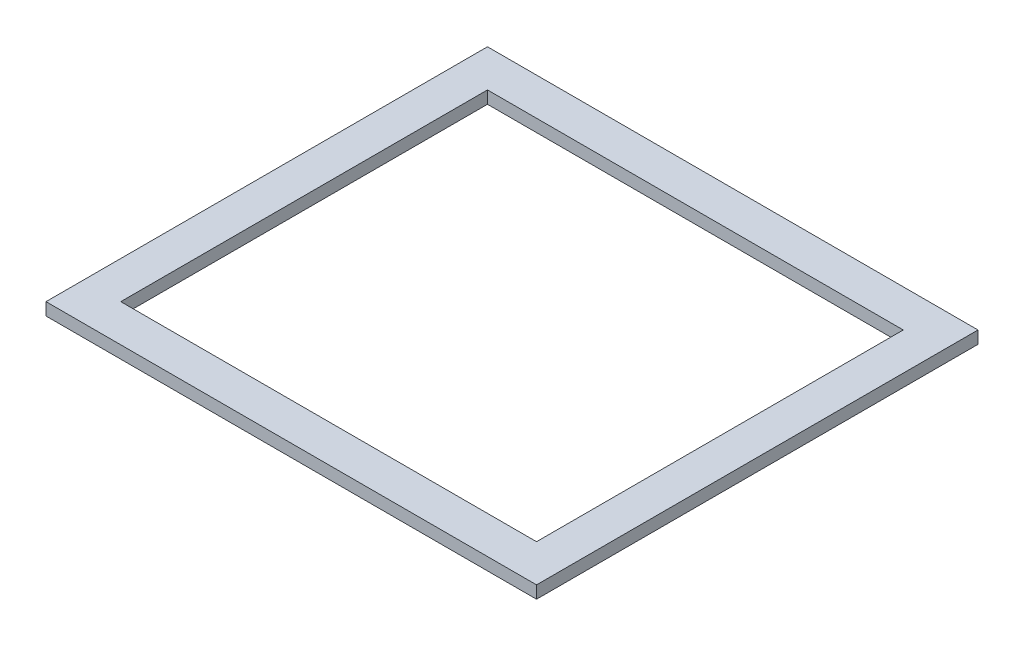
ISO-10303-21;
HEADER;
FILE_DESCRIPTION(('STEP AP214'),'2;1');
FILE_NAME('part.step','',(''),(''),'','','');
FILE_SCHEMA(('AUTOMOTIVE_DESIGN { 1 0 10303 214 1 1 1 1 }'));
ENDSEC;
DATA;
#1=APPLICATION_CONTEXT('core data for automotive mechanical design processes');
#2=APPLICATION_PROTOCOL_DEFINITION('international standard','automotive_design',2000,#1);
#3=PRODUCT_CONTEXT('',#1,'mechanical');
#4=PRODUCT('Part','Part','',(#3));
#5=PRODUCT_RELATED_PRODUCT_CATEGORY('part','',(#4));
#6=PRODUCT_DEFINITION_FORMATION('','',#4);
#7=PRODUCT_DEFINITION_CONTEXT('part definition',#1,'design');
#8=PRODUCT_DEFINITION('design','',#6,#7);
#9=PRODUCT_DEFINITION_SHAPE('','',#8);
#10=(LENGTH_UNIT() NAMED_UNIT(*) SI_UNIT(.MILLI.,.METRE.));
#11=(NAMED_UNIT(*) PLANE_ANGLE_UNIT() SI_UNIT($,.RADIAN.));
#12=(NAMED_UNIT(*) SI_UNIT($,.STERADIAN.) SOLID_ANGLE_UNIT());
#13=UNCERTAINTY_MEASURE_WITH_UNIT(LENGTH_MEASURE(1.E-05),#10,'distance_accuracy_value','');
#14=(GEOMETRIC_REPRESENTATION_CONTEXT(3) GLOBAL_UNCERTAINTY_ASSIGNED_CONTEXT((#13)) GLOBAL_UNIT_ASSIGNED_CONTEXT((#10,
#11,#12)) REPRESENTATION_CONTEXT('',''));
#15=CARTESIAN_POINT('',(0.,0.,0.));
#16=DIRECTION('',(0.,0.,1.));
#17=DIRECTION('',(1.,0.,0.));
#18=AXIS2_PLACEMENT_3D('',#15,#16,#17);
#19=CARTESIAN_POINT('',(0.,25.4,0.));
#20=DIRECTION('',(0.,1.,0.));
#21=DIRECTION('',(0.,0.,1.));
#22=AXIS2_PLACEMENT_3D('',#19,#20,#21);
#23=PLANE('',#22);
#24=DIRECTION('',(0.,0.,1.));
#25=VECTOR('',#24,1.);
#26=CARTESIAN_POINT('',(0.,25.4,0.));
#27=LINE('',#26,#25);
#28=CARTESIAN_POINT('',(0.,25.4,0.));
#29=VERTEX_POINT('',#28);
#30=CARTESIAN_POINT('',(1.10218211923262E-13,25.4,900.));
#31=VERTEX_POINT('',#30);
#32=EDGE_CURVE('E136',#29,#31,#27,.T.);
#33=ORIENTED_EDGE('',*,*,#32,.T.);
#34=DIRECTION('',(1.,0.,0.));
#35=VECTOR('',#34,1.);
#36=CARTESIAN_POINT('',(1.10218211923262E-13,25.4,900.));
#37=LINE('',#36,#35);
#38=CARTESIAN_POINT('',(1000.,25.4,900.));
#39=VERTEX_POINT('',#38);
#40=EDGE_CURVE('E139',#31,#39,#37,.T.);
#41=ORIENTED_EDGE('',*,*,#40,.T.);
#42=DIRECTION('',(0.,0.,-1.));
#43=VECTOR('',#42,1.);
#44=CARTESIAN_POINT('',(1000.,25.4,0.));
#45=LINE('',#44,#43);
#46=CARTESIAN_POINT('',(1000.,25.4,0.));
#47=VERTEX_POINT('',#46);
#48=EDGE_CURVE('E142',#39,#47,#45,.T.);
#49=ORIENTED_EDGE('',*,*,#48,.T.);
#50=DIRECTION('',(-1.,0.,0.));
#51=VECTOR('',#50,1.);
#52=CARTESIAN_POINT('',(0.,25.4,0.));
#53=LINE('',#52,#51);
#54=EDGE_CURVE('E144',#47,#29,#53,.T.);
#55=ORIENTED_EDGE('',*,*,#54,.T.);
#56=EDGE_LOOP('',(#33,#41,#49,#55));
#57=FACE_BOUND('',#56,.T.);
#58=DIRECTION('',(1.,0.,0.));
#59=VECTOR('',#58,1.);
#60=CARTESIAN_POINT('',(76.2000000000001,25.4,823.8));
#61=LINE('',#60,#59);
#62=CARTESIAN_POINT('',(76.2000000000001,25.4,823.8));
#63=VERTEX_POINT('',#62);
#64=CARTESIAN_POINT('',(923.8,25.4,823.8));
#65=VERTEX_POINT('',#64);
#66=EDGE_CURVE('E108',#63,#65,#61,.T.);
#67=ORIENTED_EDGE('',*,*,#66,.F.);
#68=DIRECTION('',(0.,0.,1.));
#69=VECTOR('',#68,1.);
#70=CARTESIAN_POINT('',(76.2,25.4,76.2));
#71=LINE('',#70,#69);
#72=CARTESIAN_POINT('',(76.2,25.4,76.2));
#73=VERTEX_POINT('',#72);
#74=EDGE_CURVE('E100',#73,#63,#71,.T.);
#75=ORIENTED_EDGE('',*,*,#74,.F.);
#76=DIRECTION('',(-1.,0.,0.));
#77=VECTOR('',#76,1.);
#78=CARTESIAN_POINT('',(76.2,25.4,76.2));
#79=LINE('',#78,#77);
#80=CARTESIAN_POINT('',(923.8,25.4,76.2));
#81=VERTEX_POINT('',#80);
#82=EDGE_CURVE('E122',#81,#73,#79,.T.);
#83=ORIENTED_EDGE('',*,*,#82,.F.);
#84=DIRECTION('',(0.,0.,-1.));
#85=VECTOR('',#84,1.);
#86=CARTESIAN_POINT('',(923.8,25.4,76.2));
#87=LINE('',#86,#85);
#88=EDGE_CURVE('E120',#65,#81,#87,.T.);
#89=ORIENTED_EDGE('',*,*,#88,.F.);
#90=EDGE_LOOP('',(#67,#75,#83,#89));
#91=FACE_BOUND('',#90,.T.);
#92=ADVANCED_FACE('F35',(#57,#91),#23,.T.);
#93=CARTESIAN_POINT('',(0.,0.,0.));
#94=DIRECTION('',(0.,1.,0.));
#95=DIRECTION('',(0.,0.,1.));
#96=AXIS2_PLACEMENT_3D('',#93,#94,#95);
#97=PLANE('',#96);
#98=DIRECTION('',(0.,0.,1.));
#99=VECTOR('',#98,1.);
#100=CARTESIAN_POINT('',(0.,0.,0.));
#101=LINE('',#100,#99);
#102=CARTESIAN_POINT('',(0.,0.,0.));
#103=VERTEX_POINT('',#102);
#104=CARTESIAN_POINT('',(1.10218211923262E-13,0.,900.));
#105=VERTEX_POINT('',#104);
#106=EDGE_CURVE('E116',#103,#105,#101,.T.);
#107=ORIENTED_EDGE('',*,*,#106,.F.);
#108=DIRECTION('',(-1.,0.,0.));
#109=VECTOR('',#108,1.);
#110=CARTESIAN_POINT('',(0.,0.,0.));
#111=LINE('',#110,#109);
#112=CARTESIAN_POINT('',(1000.,0.,0.));
#113=VERTEX_POINT('',#112);
#114=EDGE_CURVE('E140',#113,#103,#111,.T.);
#115=ORIENTED_EDGE('',*,*,#114,.F.);
#116=DIRECTION('',(0.,0.,-1.));
#117=VECTOR('',#116,1.);
#118=CARTESIAN_POINT('',(1000.,0.,0.));
#119=LINE('',#118,#117);
#120=CARTESIAN_POINT('',(1000.,0.,900.));
#121=VERTEX_POINT('',#120);
#122=EDGE_CURVE('E151',#121,#113,#119,.T.);
#123=ORIENTED_EDGE('',*,*,#122,.F.);
#124=DIRECTION('',(1.,0.,0.));
#125=VECTOR('',#124,1.);
#126=CARTESIAN_POINT('',(1.10218211923262E-13,0.,900.));
#127=LINE('',#126,#125);
#128=EDGE_CURVE('E149',#105,#121,#127,.T.);
#129=ORIENTED_EDGE('',*,*,#128,.F.);
#130=EDGE_LOOP('',(#107,#115,#123,#129));
#131=FACE_BOUND('',#130,.T.);
#132=DIRECTION('',(0.,0.,1.));
#133=VECTOR('',#132,1.);
#134=CARTESIAN_POINT('',(76.2,0.,76.2));
#135=LINE('',#134,#133);
#136=CARTESIAN_POINT('',(76.2,0.,76.2));
#137=VERTEX_POINT('',#136);
#138=CARTESIAN_POINT('',(76.2000000000001,0.,823.8));
#139=VERTEX_POINT('',#138);
#140=EDGE_CURVE('E58',#137,#139,#135,.T.);
#141=ORIENTED_EDGE('',*,*,#140,.T.);
#142=DIRECTION('',(1.,0.,0.));
#143=VECTOR('',#142,1.);
#144=CARTESIAN_POINT('',(76.2000000000001,0.,823.8));
#145=LINE('',#144,#143);
#146=CARTESIAN_POINT('',(923.8,0.,823.8));
#147=VERTEX_POINT('',#146);
#148=EDGE_CURVE('E115',#139,#147,#145,.T.);
#149=ORIENTED_EDGE('',*,*,#148,.T.);
#150=DIRECTION('',(0.,0.,-1.));
#151=VECTOR('',#150,1.);
#152=CARTESIAN_POINT('',(923.8,0.,76.2));
#153=LINE('',#152,#151);
#154=CARTESIAN_POINT('',(923.8,0.,76.2));
#155=VERTEX_POINT('',#154);
#156=EDGE_CURVE('E128',#147,#155,#153,.T.);
#157=ORIENTED_EDGE('',*,*,#156,.T.);
#158=DIRECTION('',(-1.,0.,0.));
#159=VECTOR('',#158,1.);
#160=CARTESIAN_POINT('',(76.2,0.,76.2));
#161=LINE('',#160,#159);
#162=EDGE_CURVE('E109',#155,#137,#161,.T.);
#163=ORIENTED_EDGE('',*,*,#162,.T.);
#164=EDGE_LOOP('',(#141,#149,#157,#163));
#165=FACE_BOUND('',#164,.T.);
#166=ADVANCED_FACE('F169',(#131,#165),#97,.F.);
#167=CARTESIAN_POINT('',(0.,25.4,0.));
#168=DIRECTION('',(1.,0.,0.));
#169=DIRECTION('',(0.,0.,-1.));
#170=AXIS2_PLACEMENT_3D('',#167,#168,#169);
#171=PLANE('',#170);
#172=ORIENTED_EDGE('',*,*,#106,.T.);
#173=DIRECTION('',(0.,-1.,0.));
#174=VECTOR('',#173,1.);
#175=CARTESIAN_POINT('',(1.10218211923262E-13,25.4,900.));
#176=LINE('',#175,#174);
#177=EDGE_CURVE('E11',#31,#105,#176,.T.);
#178=ORIENTED_EDGE('',*,*,#177,.F.);
#179=ORIENTED_EDGE('',*,*,#32,.F.);
#180=DIRECTION('',(0.,-1.,0.));
#181=VECTOR('',#180,1.);
#182=CARTESIAN_POINT('',(0.,25.4,0.));
#183=LINE('',#182,#181);
#184=EDGE_CURVE('E146',#29,#103,#183,.T.);
#185=ORIENTED_EDGE('',*,*,#184,.T.);
#186=EDGE_LOOP('',(#172,#178,#179,#185));
#187=FACE_BOUND('',#186,.T.);
#188=ADVANCED_FACE('F37',(#187),#171,.F.);
#189=CARTESIAN_POINT('',(1.10218211923262E-13,25.4,900.));
#190=DIRECTION('',(0.,0.,-1.));
#191=DIRECTION('',(-1.,0.,0.));
#192=AXIS2_PLACEMENT_3D('',#189,#190,#191);
#193=PLANE('',#192);
#194=ORIENTED_EDGE('',*,*,#128,.T.);
#195=DIRECTION('',(0.,-1.,0.));
#196=VECTOR('',#195,1.);
#197=CARTESIAN_POINT('',(1000.,25.4,900.));
#198=LINE('',#197,#196);
#199=EDGE_CURVE('E43',#39,#121,#198,.T.);
#200=ORIENTED_EDGE('',*,*,#199,.F.);
#201=ORIENTED_EDGE('',*,*,#40,.F.);
#202=ORIENTED_EDGE('',*,*,#177,.T.);
#203=EDGE_LOOP('',(#194,#200,#201,#202));
#204=FACE_BOUND('',#203,.T.);
#205=ADVANCED_FACE('F179',(#204),#193,.F.);
#206=CARTESIAN_POINT('',(1000.,25.4,0.));
#207=DIRECTION('',(-1.,0.,0.));
#208=DIRECTION('',(0.,0.,1.));
#209=AXIS2_PLACEMENT_3D('',#206,#207,#208);
#210=PLANE('',#209);
#211=ORIENTED_EDGE('',*,*,#122,.T.);
#212=DIRECTION('',(0.,-1.,0.));
#213=VECTOR('',#212,1.);
#214=CARTESIAN_POINT('',(1000.,25.4,0.));
#215=LINE('',#214,#213);
#216=EDGE_CURVE('E156',#47,#113,#215,.T.);
#217=ORIENTED_EDGE('',*,*,#216,.F.);
#218=ORIENTED_EDGE('',*,*,#48,.F.);
#219=ORIENTED_EDGE('',*,*,#199,.T.);
#220=EDGE_LOOP('',(#211,#217,#218,#219));
#221=FACE_BOUND('',#220,.T.);
#222=ADVANCED_FACE('F163',(#221),#210,.F.);
#223=CARTESIAN_POINT('',(0.,25.4,0.));
#224=DIRECTION('',(0.,0.,1.));
#225=DIRECTION('',(1.,0.,0.));
#226=AXIS2_PLACEMENT_3D('',#223,#224,#225);
#227=PLANE('',#226);
#228=ORIENTED_EDGE('',*,*,#114,.T.);
#229=ORIENTED_EDGE('',*,*,#184,.F.);
#230=ORIENTED_EDGE('',*,*,#54,.F.);
#231=ORIENTED_EDGE('',*,*,#216,.T.);
#232=EDGE_LOOP('',(#228,#229,#230,#231));
#233=FACE_BOUND('',#232,.T.);
#234=ADVANCED_FACE('F173',(#233),#227,.F.);
#235=CARTESIAN_POINT('',(76.2,25.4,76.2));
#236=DIRECTION('',(1.,0.,0.));
#237=DIRECTION('',(0.,0.,-1.));
#238=AXIS2_PLACEMENT_3D('',#235,#236,#237);
#239=PLANE('',#238);
#240=ORIENTED_EDGE('',*,*,#140,.F.);
#241=DIRECTION('',(0.,-1.,0.));
#242=VECTOR('',#241,1.);
#243=CARTESIAN_POINT('',(76.2,25.4,76.2));
#244=LINE('',#243,#242);
#245=EDGE_CURVE('E104',#73,#137,#244,.T.);
#246=ORIENTED_EDGE('',*,*,#245,.F.);
#247=ORIENTED_EDGE('',*,*,#74,.T.);
#248=DIRECTION('',(0.,-1.,0.));
#249=VECTOR('',#248,1.);
#250=CARTESIAN_POINT('',(76.2000000000001,25.4,823.8));
#251=LINE('',#250,#249);
#252=EDGE_CURVE('E103',#63,#139,#251,.T.);
#253=ORIENTED_EDGE('',*,*,#252,.T.);
#254=EDGE_LOOP('',(#240,#246,#247,#253));
#255=FACE_BOUND('',#254,.T.);
#256=ADVANCED_FACE('F102',(#255),#239,.T.);
#257=CARTESIAN_POINT('',(76.2000000000001,25.4,823.8));
#258=DIRECTION('',(0.,0.,-1.));
#259=DIRECTION('',(-1.,0.,0.));
#260=AXIS2_PLACEMENT_3D('',#257,#258,#259);
#261=PLANE('',#260);
#262=ORIENTED_EDGE('',*,*,#148,.F.);
#263=ORIENTED_EDGE('',*,*,#252,.F.);
#264=ORIENTED_EDGE('',*,*,#66,.T.);
#265=DIRECTION('',(0.,-1.,0.));
#266=VECTOR('',#265,1.);
#267=CARTESIAN_POINT('',(923.8,25.4,823.8));
#268=LINE('',#267,#266);
#269=EDGE_CURVE('E117',#65,#147,#268,.T.);
#270=ORIENTED_EDGE('',*,*,#269,.T.);
#271=EDGE_LOOP('',(#262,#263,#264,#270));
#272=FACE_BOUND('',#271,.T.);
#273=ADVANCED_FACE('F112',(#272),#261,.T.);
#274=CARTESIAN_POINT('',(923.8,25.4,76.2));
#275=DIRECTION('',(-1.,0.,0.));
#276=DIRECTION('',(0.,0.,1.));
#277=AXIS2_PLACEMENT_3D('',#274,#275,#276);
#278=PLANE('',#277);
#279=ORIENTED_EDGE('',*,*,#156,.F.);
#280=ORIENTED_EDGE('',*,*,#269,.F.);
#281=ORIENTED_EDGE('',*,*,#88,.T.);
#282=DIRECTION('',(0.,-1.,0.));
#283=VECTOR('',#282,1.);
#284=CARTESIAN_POINT('',(923.8,25.4,76.2));
#285=LINE('',#284,#283);
#286=EDGE_CURVE('E50',#81,#155,#285,.T.);
#287=ORIENTED_EDGE('',*,*,#286,.T.);
#288=EDGE_LOOP('',(#279,#280,#281,#287));
#289=FACE_BOUND('',#288,.T.);
#290=ADVANCED_FACE('F202',(#289),#278,.T.);
#291=CARTESIAN_POINT('',(76.2,25.4,76.2));
#292=DIRECTION('',(0.,0.,1.));
#293=DIRECTION('',(1.,0.,0.));
#294=AXIS2_PLACEMENT_3D('',#291,#292,#293);
#295=PLANE('',#294);
#296=ORIENTED_EDGE('',*,*,#162,.F.);
#297=ORIENTED_EDGE('',*,*,#286,.F.);
#298=ORIENTED_EDGE('',*,*,#82,.T.);
#299=ORIENTED_EDGE('',*,*,#245,.T.);
#300=EDGE_LOOP('',(#296,#297,#298,#299));
#301=FACE_BOUND('',#300,.T.);
#302=ADVANCED_FACE('F206',(#301),#295,.T.);
#303=CLOSED_SHELL('',(#92,#166,#188,#205,#222,#234,#256,#273,#290,#302));
#304=MANIFOLD_SOLID_BREP('B2',#303);
#305=ADVANCED_BREP_SHAPE_REPRESENTATION('',(#18,#304),#14);
#306=SHAPE_DEFINITION_REPRESENTATION(#9,#305);
ENDSEC;
END-ISO-10303-21;
